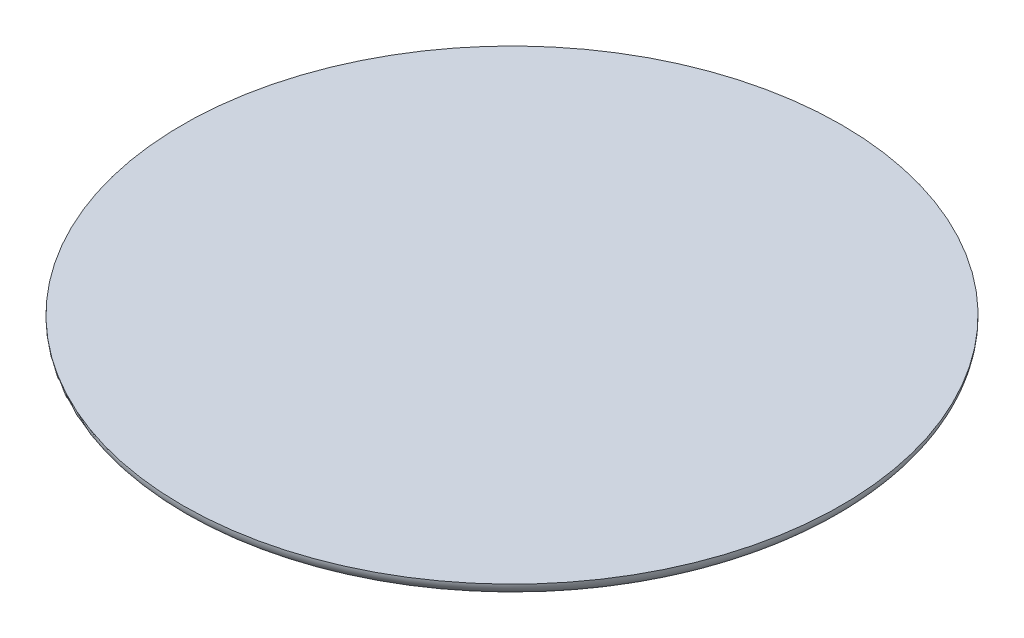
ISO-10303-21;
HEADER;
FILE_DESCRIPTION(('STEP AP214'),'2;1');
FILE_NAME('part.step','',(''),(''),'','','');
FILE_SCHEMA(('AUTOMOTIVE_DESIGN { 1 0 10303 214 1 1 1 1 }'));
ENDSEC;
DATA;
#1=APPLICATION_CONTEXT('core data for automotive mechanical design processes');
#2=APPLICATION_PROTOCOL_DEFINITION('international standard','automotive_design',2000,#1);
#3=PRODUCT_CONTEXT('',#1,'mechanical');
#4=PRODUCT('Part','Part','',(#3));
#5=PRODUCT_RELATED_PRODUCT_CATEGORY('part','',(#4));
#6=PRODUCT_DEFINITION_FORMATION('','',#4);
#7=PRODUCT_DEFINITION_CONTEXT('part definition',#1,'design');
#8=PRODUCT_DEFINITION('design','',#6,#7);
#9=PRODUCT_DEFINITION_SHAPE('','',#8);
#10=(LENGTH_UNIT() NAMED_UNIT(*) SI_UNIT(.MILLI.,.METRE.));
#11=(NAMED_UNIT(*) PLANE_ANGLE_UNIT() SI_UNIT($,.RADIAN.));
#12=(NAMED_UNIT(*) SI_UNIT($,.STERADIAN.) SOLID_ANGLE_UNIT());
#13=UNCERTAINTY_MEASURE_WITH_UNIT(LENGTH_MEASURE(1.E-05),#10,'distance_accuracy_value','');
#14=(GEOMETRIC_REPRESENTATION_CONTEXT(3) GLOBAL_UNCERTAINTY_ASSIGNED_CONTEXT((#13)) GLOBAL_UNIT_ASSIGNED_CONTEXT((#10,
#11,#12)) REPRESENTATION_CONTEXT('',''));
#15=CARTESIAN_POINT('',(0.,0.,0.));
#16=DIRECTION('',(0.,0.,1.));
#17=DIRECTION('',(1.,0.,0.));
#18=AXIS2_PLACEMENT_3D('',#15,#16,#17);
#19=CARTESIAN_POINT('',(0.,2.,0.));
#20=DIRECTION('',(0.,1.,0.));
#21=DIRECTION('',(0.,0.,1.));
#22=AXIS2_PLACEMENT_3D('',#19,#20,#21);
#23=PLANE('',#22);
#24=CARTESIAN_POINT('',(0.,2.,0.));
#25=DIRECTION('',(0.,1.,0.));
#26=DIRECTION('',(0.,0.,1.));
#27=AXIS2_PLACEMENT_3D('',#24,#25,#26);
#28=CIRCLE('',#27,50.);
#29=CARTESIAN_POINT('',(0.,2.,50.));
#30=VERTEX_POINT('',#29);
#31=EDGE_CURVE('E49',#30,#30,#28,.T.);
#32=ORIENTED_EDGE('',*,*,#31,.T.);
#33=EDGE_LOOP('',(#32));
#34=FACE_BOUND('',#33,.T.);
#35=ADVANCED_FACE('F41',(#34),#23,.T.);
#36=CARTESIAN_POINT('',(0.,0.,0.));
#37=DIRECTION('',(0.,1.,0.));
#38=DIRECTION('',(0.,0.,1.));
#39=AXIS2_PLACEMENT_3D('',#36,#37,#38);
#40=PLANE('',#39);
#41=CARTESIAN_POINT('',(0.,0.,0.));
#42=DIRECTION('',(0.,1.,0.));
#43=DIRECTION('',(0.,0.,1.));
#44=AXIS2_PLACEMENT_3D('',#41,#42,#43);
#45=CIRCLE('',#44,48.);
#46=CARTESIAN_POINT('',(0.,0.,48.));
#47=VERTEX_POINT('',#46);
#48=EDGE_CURVE('E10',#47,#47,#45,.F.);
#49=ORIENTED_EDGE('',*,*,#48,.T.);
#50=EDGE_LOOP('',(#49));
#51=FACE_BOUND('',#50,.T.);
#52=ADVANCED_FACE('F58',(#51),#40,.F.);
#53=CARTESIAN_POINT('',(0.,2.,0.));
#54=DIRECTION('',(0.,1.,0.));
#55=DIRECTION('',(0.,0.,1.));
#56=AXIS2_PLACEMENT_3D('',#53,#54,#55);
#57=TOROIDAL_SURFACE('',#56,48.,2.);
#58=ORIENTED_EDGE('',*,*,#48,.F.);
#59=EDGE_LOOP('',(#58));
#60=FACE_BOUND('',#59,.T.);
#61=ORIENTED_EDGE('',*,*,#31,.F.);
#62=EDGE_LOOP('',(#61));
#63=FACE_BOUND('',#62,.T.);
#64=ADVANCED_FACE('F43',(#60,#63),#57,.T.);
#65=CLOSED_SHELL('',(#35,#52,#64));
#66=MANIFOLD_SOLID_BREP('B2',#65);
#67=ADVANCED_BREP_SHAPE_REPRESENTATION('',(#18,#66),#14);
#68=SHAPE_DEFINITION_REPRESENTATION(#9,#67);
ENDSEC;
END-ISO-10303-21;
